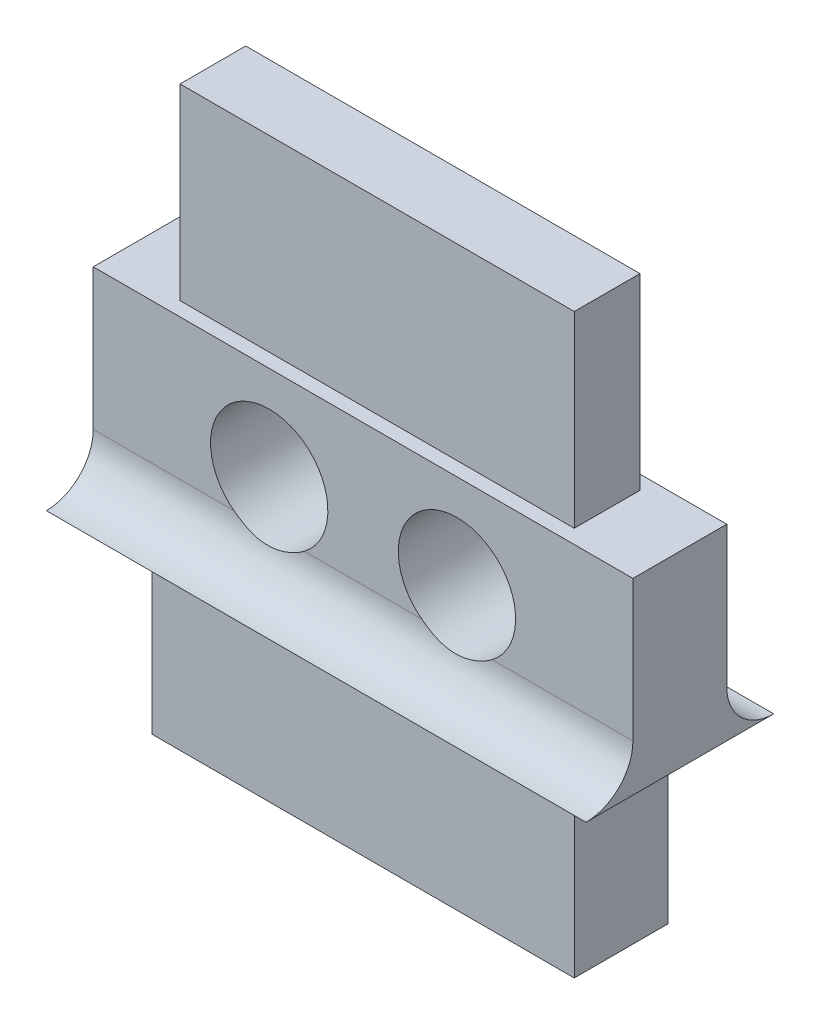
ISO-10303-21;
HEADER;
FILE_DESCRIPTION(('STEP AP214'),'2;1');
FILE_NAME('part.step','',(''),(''),'','','');
FILE_SCHEMA(('AUTOMOTIVE_DESIGN { 1 0 10303 214 1 1 1 1 }'));
ENDSEC;
DATA;
#1=APPLICATION_CONTEXT('core data for automotive mechanical design processes');
#2=APPLICATION_PROTOCOL_DEFINITION('international standard','automotive_design',2000,#1);
#3=PRODUCT_CONTEXT('',#1,'mechanical');
#4=PRODUCT('Part','Part','',(#3));
#5=PRODUCT_RELATED_PRODUCT_CATEGORY('part','',(#4));
#6=PRODUCT_DEFINITION_FORMATION('','',#4);
#7=PRODUCT_DEFINITION_CONTEXT('part definition',#1,'design');
#8=PRODUCT_DEFINITION('design','',#6,#7);
#9=PRODUCT_DEFINITION_SHAPE('','',#8);
#10=(LENGTH_UNIT() NAMED_UNIT(*) SI_UNIT(.MILLI.,.METRE.));
#11=(NAMED_UNIT(*) PLANE_ANGLE_UNIT() SI_UNIT($,.RADIAN.));
#12=(NAMED_UNIT(*) SI_UNIT($,.STERADIAN.) SOLID_ANGLE_UNIT());
#13=UNCERTAINTY_MEASURE_WITH_UNIT(LENGTH_MEASURE(1.E-05),#10,'distance_accuracy_value','');
#14=(GEOMETRIC_REPRESENTATION_CONTEXT(3) GLOBAL_UNCERTAINTY_ASSIGNED_CONTEXT((#13)) GLOBAL_UNIT_ASSIGNED_CONTEXT((#10,
#11,#12)) REPRESENTATION_CONTEXT('',''));
#15=CARTESIAN_POINT('',(0.,0.,0.));
#16=DIRECTION('',(0.,0.,1.));
#17=DIRECTION('',(1.,0.,0.));
#18=AXIS2_PLACEMENT_3D('',#15,#16,#17);
#19=CARTESIAN_POINT('',(0.,0.,0.));
#20=DIRECTION('',(0.,0.,1.));
#21=DIRECTION('',(1.,0.,0.));
#22=AXIS2_PLACEMENT_3D('',#19,#20,#21);
#23=PLANE('',#22);
#24=DIRECTION('',(-1.,0.,0.));
#25=VECTOR('',#24,1.);
#26=CARTESIAN_POINT('',(1.24999999999997,8.00000000000001,0.));
#27=LINE('',#26,#25);
#28=CARTESIAN_POINT('',(11.5007199999999,8.00000000000001,0.));
#29=VERTEX_POINT('',#28);
#30=CARTESIAN_POINT('',(0.,8.00000000000001,0.));
#31=VERTEX_POINT('',#30);
#32=EDGE_CURVE('E301',#29,#31,#27,.T.);
#33=ORIENTED_EDGE('',*,*,#32,.F.);
#34=DIRECTION('',(0.,1.,0.));
#35=VECTOR('',#34,1.);
#36=CARTESIAN_POINT('',(11.5007199999999,8.00000000000001,0.));
#37=LINE('',#36,#35);
#38=CARTESIAN_POINT('',(11.5007199999999,5.,0.));
#39=VERTEX_POINT('',#38);
#40=EDGE_CURVE('E62',#39,#29,#37,.T.);
#41=ORIENTED_EDGE('',*,*,#40,.F.);
#42=DIRECTION('',(-1.,0.,0.));
#43=VECTOR('',#42,1.);
#44=CARTESIAN_POINT('',(12.914933562373,5.,0.));
#45=LINE('',#44,#43);
#46=CARTESIAN_POINT('',(8.50071999999964,5.,0.));
#47=VERTEX_POINT('',#46);
#48=EDGE_CURVE('E236',#39,#47,#45,.T.);
#49=ORIENTED_EDGE('',*,*,#48,.T.);
#50=CARTESIAN_POINT('',(7.75071999999997,6.00000000000023,0.));
#51=DIRECTION('',(0.,0.,1.));
#52=DIRECTION('',(1.,0.,0.));
#53=AXIS2_PLACEMENT_3D('',#50,#51,#52);
#54=CIRCLE('',#53,1.24999999999998);
#55=CARTESIAN_POINT('',(7.00072000000032,5.,0.));
#56=VERTEX_POINT('',#55);
#57=EDGE_CURVE('E267',#47,#56,#54,.T.);
#58=ORIENTED_EDGE('',*,*,#57,.T.);
#59=CARTESIAN_POINT('',(4.49999999999962,5.,0.));
#60=VERTEX_POINT('',#59);
#61=EDGE_CURVE('E241',#56,#60,#45,.T.);
#62=ORIENTED_EDGE('',*,*,#61,.T.);
#63=CARTESIAN_POINT('',(3.74999999999997,6.00000000000023,0.));
#64=DIRECTION('',(0.,0.,1.));
#65=DIRECTION('',(1.,0.,0.));
#66=AXIS2_PLACEMENT_3D('',#63,#64,#65);
#67=CIRCLE('',#66,1.24999999999997);
#68=CARTESIAN_POINT('',(3.00000000000032,5.,0.));
#69=VERTEX_POINT('',#68);
#70=EDGE_CURVE('E263',#60,#69,#67,.T.);
#71=ORIENTED_EDGE('',*,*,#70,.T.);
#72=CARTESIAN_POINT('',(0.,5.,0.));
#73=VERTEX_POINT('',#72);
#74=EDGE_CURVE('E242',#69,#73,#45,.T.);
#75=ORIENTED_EDGE('',*,*,#74,.T.);
#76=DIRECTION('',(0.,-1.,0.));
#77=VECTOR('',#76,1.);
#78=CARTESIAN_POINT('',(0.,8.00000000000001,0.));
#79=LINE('',#78,#77);
#80=EDGE_CURVE('E280',#31,#73,#79,.T.);
#81=ORIENTED_EDGE('',*,*,#80,.F.);
#82=EDGE_LOOP('',(#33,#41,#49,#58,#62,#71,#75,#81));
#83=FACE_BOUND('',#82,.T.);
#84=ADVANCED_FACE('F34',(#83),#23,.F.);
#85=CARTESIAN_POINT('',(0.,0.,2.));
#86=DIRECTION('',(0.,0.,1.));
#87=DIRECTION('',(1.,0.,0.));
#88=AXIS2_PLACEMENT_3D('',#85,#86,#87);
#89=PLANE('',#88);
#90=DIRECTION('',(-1.,0.,0.));
#91=VECTOR('',#90,1.);
#92=CARTESIAN_POINT('',(10.25072,8.00000000000001,2.));
#93=LINE('',#92,#91);
#94=CARTESIAN_POINT('',(11.5007199999999,8.00000000000001,2.));
#95=VERTEX_POINT('',#94);
#96=CARTESIAN_POINT('',(0.,8.00000000000001,2.));
#97=VERTEX_POINT('',#96);
#98=EDGE_CURVE('E287',#95,#97,#93,.T.);
#99=ORIENTED_EDGE('',*,*,#98,.T.);
#100=DIRECTION('',(0.,-1.,0.));
#101=VECTOR('',#100,1.);
#102=CARTESIAN_POINT('',(0.,8.00000000000001,2.));
#103=LINE('',#102,#101);
#104=CARTESIAN_POINT('',(0.,5.,2.));
#105=VERTEX_POINT('',#104);
#106=EDGE_CURVE('E289',#97,#105,#103,.T.);
#107=ORIENTED_EDGE('',*,*,#106,.T.);
#108=DIRECTION('',(-1.,0.,0.));
#109=VECTOR('',#108,1.);
#110=CARTESIAN_POINT('',(12.914933562373,5.,2.));
#111=LINE('',#110,#109);
#112=CARTESIAN_POINT('',(3.00000000000032,5.,2.));
#113=VERTEX_POINT('',#112);
#114=EDGE_CURVE('E258',#113,#105,#111,.T.);
#115=ORIENTED_EDGE('',*,*,#114,.F.);
#116=CARTESIAN_POINT('',(3.74999999999997,6.00000000000023,2.));
#117=DIRECTION('',(0.,0.,1.));
#118=DIRECTION('',(1.,0.,0.));
#119=AXIS2_PLACEMENT_3D('',#116,#117,#118);
#120=CIRCLE('',#119,1.24999999999997);
#121=CARTESIAN_POINT('',(4.49999999999962,5.,2.));
#122=VERTEX_POINT('',#121);
#123=EDGE_CURVE('E264',#122,#113,#120,.T.);
#124=ORIENTED_EDGE('',*,*,#123,.F.);
#125=CARTESIAN_POINT('',(7.00072000000031,5.,2.));
#126=VERTEX_POINT('',#125);
#127=EDGE_CURVE('E257',#126,#122,#111,.T.);
#128=ORIENTED_EDGE('',*,*,#127,.F.);
#129=CARTESIAN_POINT('',(7.75071999999997,6.00000000000023,2.));
#130=DIRECTION('',(0.,0.,1.));
#131=DIRECTION('',(1.,0.,0.));
#132=AXIS2_PLACEMENT_3D('',#129,#130,#131);
#133=CIRCLE('',#132,1.24999999999998);
#134=CARTESIAN_POINT('',(8.50071999999963,5.,2.));
#135=VERTEX_POINT('',#134);
#136=EDGE_CURVE('E270',#135,#126,#133,.T.);
#137=ORIENTED_EDGE('',*,*,#136,.F.);
#138=CARTESIAN_POINT('',(11.5007199999999,5.,2.));
#139=VERTEX_POINT('',#138);
#140=EDGE_CURVE('E254',#139,#135,#111,.T.);
#141=ORIENTED_EDGE('',*,*,#140,.F.);
#142=DIRECTION('',(0.,1.,0.));
#143=VECTOR('',#142,1.);
#144=CARTESIAN_POINT('',(11.5007199999999,8.00000000000001,2.));
#145=LINE('',#144,#143);
#146=EDGE_CURVE('E285',#139,#95,#145,.T.);
#147=ORIENTED_EDGE('',*,*,#146,.T.);
#148=EDGE_LOOP('',(#99,#107,#115,#124,#128,#137,#141,#147));
#149=FACE_BOUND('',#148,.T.);
#150=ADVANCED_FACE('F343',(#149),#89,.T.);
#151=DIRECTION('',(-1.,0.,0.));
#152=VECTOR('',#151,1.);
#153=CARTESIAN_POINT('',(12.914933562373,4.,2.));
#154=LINE('',#153,#152);
#155=CARTESIAN_POINT('',(10.25072,4.,2.));
#156=VERTEX_POINT('',#155);
#157=CARTESIAN_POINT('',(1.24999999999997,4.,2.));
#158=VERTEX_POINT('',#157);
#159=EDGE_CURVE('E251',#156,#158,#154,.T.);
#160=ORIENTED_EDGE('',*,*,#159,.T.);
#161=DIRECTION('',(0.,-1.,0.));
#162=VECTOR('',#161,1.);
#163=CARTESIAN_POINT('',(1.24999999999997,4.,2.));
#164=LINE('',#163,#162);
#165=CARTESIAN_POINT('',(1.24999999999997,0.,2.));
#166=VERTEX_POINT('',#165);
#167=EDGE_CURVE('E276',#158,#166,#164,.T.);
#168=ORIENTED_EDGE('',*,*,#167,.T.);
#169=DIRECTION('',(1.,0.,0.));
#170=VECTOR('',#169,1.);
#171=CARTESIAN_POINT('',(1.24999999999997,0.,2.));
#172=LINE('',#171,#170);
#173=CARTESIAN_POINT('',(10.25072,0.,2.));
#174=VERTEX_POINT('',#173);
#175=EDGE_CURVE('E279',#166,#174,#172,.T.);
#176=ORIENTED_EDGE('',*,*,#175,.T.);
#177=DIRECTION('',(0.,1.,0.));
#178=VECTOR('',#177,1.);
#179=CARTESIAN_POINT('',(10.25072,4.,2.));
#180=LINE('',#179,#178);
#181=EDGE_CURVE('E282',#174,#156,#180,.T.);
#182=ORIENTED_EDGE('',*,*,#181,.T.);
#183=EDGE_LOOP('',(#160,#168,#176,#182));
#184=FACE_BOUND('',#183,.T.);
#185=ADVANCED_FACE('F341',(#184),#89,.T.);
#186=DIRECTION('',(0.,-1.,0.));
#187=VECTOR('',#186,1.);
#188=CARTESIAN_POINT('',(1.24999999999997,4.,0.));
#189=LINE('',#188,#187);
#190=CARTESIAN_POINT('',(1.24999999999997,4.,0.));
#191=VERTEX_POINT('',#190);
#192=CARTESIAN_POINT('',(1.24999999999997,0.,0.));
#193=VERTEX_POINT('',#192);
#194=EDGE_CURVE('E273',#191,#193,#189,.T.);
#195=ORIENTED_EDGE('',*,*,#194,.F.);
#196=DIRECTION('',(-1.,0.,0.));
#197=VECTOR('',#196,1.);
#198=CARTESIAN_POINT('',(12.914933562373,4.,0.));
#199=LINE('',#198,#197);
#200=CARTESIAN_POINT('',(10.25072,4.,0.));
#201=VERTEX_POINT('',#200);
#202=EDGE_CURVE('E243',#201,#191,#199,.T.);
#203=ORIENTED_EDGE('',*,*,#202,.F.);
#204=DIRECTION('',(0.,1.,0.));
#205=VECTOR('',#204,1.);
#206=CARTESIAN_POINT('',(10.25072,4.,0.));
#207=LINE('',#206,#205);
#208=CARTESIAN_POINT('',(10.25072,0.,0.));
#209=VERTEX_POINT('',#208);
#210=EDGE_CURVE('E297',#209,#201,#207,.T.);
#211=ORIENTED_EDGE('',*,*,#210,.F.);
#212=DIRECTION('',(1.,0.,0.));
#213=VECTOR('',#212,1.);
#214=CARTESIAN_POINT('',(1.24999999999997,0.,0.));
#215=LINE('',#214,#213);
#216=EDGE_CURVE('E295',#193,#209,#215,.T.);
#217=ORIENTED_EDGE('',*,*,#216,.F.);
#218=EDGE_LOOP('',(#195,#203,#211,#217));
#219=FACE_BOUND('',#218,.T.);
#220=ADVANCED_FACE('F331',(#219),#23,.F.);
#221=CARTESIAN_POINT('',(1.24999999999997,4.,2.));
#222=DIRECTION('',(1.,0.,0.));
#223=DIRECTION('',(0.,1.,0.));
#224=AXIS2_PLACEMENT_3D('',#221,#222,#223);
#225=PLANE('',#224);
#226=ORIENTED_EDGE('',*,*,#194,.T.);
#227=DIRECTION('',(0.,0.,-1.));
#228=VECTOR('',#227,1.);
#229=CARTESIAN_POINT('',(1.24999999999997,0.,2.));
#230=LINE('',#229,#228);
#231=EDGE_CURVE('E47',#166,#193,#230,.T.);
#232=ORIENTED_EDGE('',*,*,#231,.F.);
#233=ORIENTED_EDGE('',*,*,#167,.F.);
#234=DIRECTION('',(0.,0.,-1.));
#235=VECTOR('',#234,1.);
#236=CARTESIAN_POINT('',(1.24999999999997,4.,2.));
#237=LINE('',#236,#235);
#238=EDGE_CURVE('E292',#158,#191,#237,.T.);
#239=ORIENTED_EDGE('',*,*,#238,.T.);
#240=EDGE_LOOP('',(#226,#232,#233,#239));
#241=FACE_BOUND('',#240,.T.);
#242=ADVANCED_FACE('F36',(#241),#225,.F.);
#243=CARTESIAN_POINT('',(1.24999999999997,0.,2.));
#244=DIRECTION('',(0.,1.,0.));
#245=DIRECTION('',(-1.,0.,0.));
#246=AXIS2_PLACEMENT_3D('',#243,#244,#245);
#247=PLANE('',#246);
#248=ORIENTED_EDGE('',*,*,#216,.T.);
#249=DIRECTION('',(0.,0.,-1.));
#250=VECTOR('',#249,1.);
#251=CARTESIAN_POINT('',(10.25072,0.,2.));
#252=LINE('',#251,#250);
#253=EDGE_CURVE('E319',#174,#209,#252,.T.);
#254=ORIENTED_EDGE('',*,*,#253,.F.);
#255=ORIENTED_EDGE('',*,*,#175,.F.);
#256=ORIENTED_EDGE('',*,*,#231,.T.);
#257=EDGE_LOOP('',(#248,#254,#255,#256));
#258=FACE_BOUND('',#257,.T.);
#259=ADVANCED_FACE('F324',(#258),#247,.F.);
#260=CARTESIAN_POINT('',(10.25072,4.,2.));
#261=DIRECTION('',(-1.,0.,0.));
#262=DIRECTION('',(0.,-1.,0.));
#263=AXIS2_PLACEMENT_3D('',#260,#261,#262);
#264=PLANE('',#263);
#265=ORIENTED_EDGE('',*,*,#210,.T.);
#266=DIRECTION('',(0.,0.,-1.));
#267=VECTOR('',#266,1.);
#268=CARTESIAN_POINT('',(10.25072,4.,2.));
#269=LINE('',#268,#267);
#270=EDGE_CURVE('E316',#156,#201,#269,.T.);
#271=ORIENTED_EDGE('',*,*,#270,.F.);
#272=ORIENTED_EDGE('',*,*,#181,.F.);
#273=ORIENTED_EDGE('',*,*,#253,.T.);
#274=EDGE_LOOP('',(#265,#271,#272,#273));
#275=FACE_BOUND('',#274,.T.);
#276=ADVANCED_FACE('F339',(#275),#264,.F.);
#277=CARTESIAN_POINT('',(11.5007199999999,8.00000000000001,2.));
#278=DIRECTION('',(-1.,0.,0.));
#279=DIRECTION('',(0.,0.,1.));
#280=AXIS2_PLACEMENT_3D('',#277,#278,#279);
#281=PLANE('',#280);
#282=DIRECTION('',(0.,0.,-1.));
#283=VECTOR('',#282,1.);
#284=CARTESIAN_POINT('',(11.5007199999999,4.,2.));
#285=LINE('',#284,#283);
#286=CARTESIAN_POINT('',(11.5007199999999,4.,3.));
#287=VERTEX_POINT('',#286);
#288=CARTESIAN_POINT('',(11.5007199999999,4.,-1.));
#289=VERTEX_POINT('',#288);
#290=EDGE_CURVE('E314',#287,#289,#285,.T.);
#291=ORIENTED_EDGE('',*,*,#290,.T.);
#292=CARTESIAN_POINT('',(11.5007199999999,5.,-1.));
#293=DIRECTION('',(-1.,0.,0.));
#294=DIRECTION('',(0.,0.,1.));
#295=AXIS2_PLACEMENT_3D('',#292,#293,#294);
#296=CIRCLE('',#295,1.);
#297=EDGE_CURVE('E233',#289,#39,#296,.T.);
#298=ORIENTED_EDGE('',*,*,#297,.T.);
#299=ORIENTED_EDGE('',*,*,#40,.T.);
#300=DIRECTION('',(0.,0.,-1.));
#301=VECTOR('',#300,1.);
#302=CARTESIAN_POINT('',(11.5007199999999,8.00000000000001,2.));
#303=LINE('',#302,#301);
#304=EDGE_CURVE('E311',#95,#29,#303,.T.);
#305=ORIENTED_EDGE('',*,*,#304,.F.);
#306=ORIENTED_EDGE('',*,*,#146,.F.);
#307=CARTESIAN_POINT('',(11.5007199999999,5.,3.));
#308=DIRECTION('',(-1.,0.,0.));
#309=DIRECTION('',(0.,0.,1.));
#310=AXIS2_PLACEMENT_3D('',#307,#308,#309);
#311=CIRCLE('',#310,1.);
#312=EDGE_CURVE('E253',#139,#287,#311,.T.);
#313=ORIENTED_EDGE('',*,*,#312,.T.);
#314=EDGE_LOOP('',(#291,#298,#299,#305,#306,#313));
#315=FACE_BOUND('',#314,.T.);
#316=ADVANCED_FACE('F365',(#315),#281,.F.);
#317=CARTESIAN_POINT('',(1.24999999999997,8.00000000000001,2.));
#318=DIRECTION('',(0.,-1.,0.));
#319=DIRECTION('',(0.,0.,-1.));
#320=AXIS2_PLACEMENT_3D('',#317,#318,#319);
#321=PLANE('',#320);
#322=ORIENTED_EDGE('',*,*,#32,.T.);
#323=DIRECTION('',(0.,0.,-1.));
#324=VECTOR('',#323,1.);
#325=CARTESIAN_POINT('',(0.,8.00000000000001,2.));
#326=LINE('',#325,#324);
#327=EDGE_CURVE('E308',#97,#31,#326,.T.);
#328=ORIENTED_EDGE('',*,*,#327,.F.);
#329=ORIENTED_EDGE('',*,*,#98,.F.);
#330=ORIENTED_EDGE('',*,*,#304,.T.);
#331=EDGE_LOOP('',(#322,#328,#329,#330));
#332=FACE_BOUND('',#331,.T.);
#333=DIRECTION('',(0.,0.,-1.));
#334=VECTOR('',#333,1.);
#335=CARTESIAN_POINT('',(9.95071999999997,8.00000000000001,0.3));
#336=LINE('',#335,#334);
#337=CARTESIAN_POINT('',(9.95071999999997,8.00000000000001,1.7));
#338=VERTEX_POINT('',#337);
#339=CARTESIAN_POINT('',(9.95071999999997,8.00000000000001,0.3));
#340=VERTEX_POINT('',#339);
#341=EDGE_CURVE('E182',#338,#340,#336,.T.);
#342=ORIENTED_EDGE('',*,*,#341,.F.);
#343=DIRECTION('',(1.,0.,0.));
#344=VECTOR('',#343,1.);
#345=CARTESIAN_POINT('',(9.95071999999997,8.00000000000001,1.7));
#346=LINE('',#345,#344);
#347=CARTESIAN_POINT('',(1.54999999999997,8.00000000000001,1.7));
#348=VERTEX_POINT('',#347);
#349=EDGE_CURVE('E176',#348,#338,#346,.T.);
#350=ORIENTED_EDGE('',*,*,#349,.F.);
#351=DIRECTION('',(0.,0.,1.));
#352=VECTOR('',#351,1.);
#353=CARTESIAN_POINT('',(1.54999999999997,8.00000000000001,0.300000000000001));
#354=LINE('',#353,#352);
#355=CARTESIAN_POINT('',(1.54999999999997,8.00000000000001,0.300000000000001));
#356=VERTEX_POINT('',#355);
#357=EDGE_CURVE('E185',#356,#348,#354,.T.);
#358=ORIENTED_EDGE('',*,*,#357,.F.);
#359=DIRECTION('',(-1.,0.,0.));
#360=VECTOR('',#359,1.);
#361=CARTESIAN_POINT('',(9.95071999999997,8.00000000000001,0.3));
#362=LINE('',#361,#360);
#363=EDGE_CURVE('E168',#340,#356,#362,.T.);
#364=ORIENTED_EDGE('',*,*,#363,.F.);
#365=EDGE_LOOP('',(#342,#350,#358,#364));
#366=FACE_BOUND('',#365,.T.);
#367=ADVANCED_FACE('F180',(#332,#366),#321,.F.);
#368=CARTESIAN_POINT('',(0.,8.00000000000001,2.));
#369=DIRECTION('',(1.,0.,0.));
#370=DIRECTION('',(0.,1.,0.));
#371=AXIS2_PLACEMENT_3D('',#368,#369,#370);
#372=PLANE('',#371);
#373=ORIENTED_EDGE('',*,*,#80,.T.);
#374=CARTESIAN_POINT('',(0.,5.,-1.));
#375=DIRECTION('',(1.,0.,0.));
#376=DIRECTION('',(0.,1.,0.));
#377=AXIS2_PLACEMENT_3D('',#374,#375,#376);
#378=CIRCLE('',#377,1.);
#379=CARTESIAN_POINT('',(0.,4.,-1.));
#380=VERTEX_POINT('',#379);
#381=EDGE_CURVE('E232',#73,#380,#378,.T.);
#382=ORIENTED_EDGE('',*,*,#381,.T.);
#383=DIRECTION('',(0.,0.,-1.));
#384=VECTOR('',#383,1.);
#385=CARTESIAN_POINT('',(0.,4.,2.));
#386=LINE('',#385,#384);
#387=CARTESIAN_POINT('',(0.,4.,3.));
#388=VERTEX_POINT('',#387);
#389=EDGE_CURVE('E306',#388,#380,#386,.T.);
#390=ORIENTED_EDGE('',*,*,#389,.F.);
#391=CARTESIAN_POINT('',(0.,5.,3.));
#392=DIRECTION('',(1.,0.,0.));
#393=DIRECTION('',(0.,-1.,0.));
#394=AXIS2_PLACEMENT_3D('',#391,#392,#393);
#395=CIRCLE('',#394,1.);
#396=EDGE_CURVE('E235',#388,#105,#395,.T.);
#397=ORIENTED_EDGE('',*,*,#396,.T.);
#398=ORIENTED_EDGE('',*,*,#106,.F.);
#399=ORIENTED_EDGE('',*,*,#327,.T.);
#400=EDGE_LOOP('',(#373,#382,#390,#397,#398,#399));
#401=FACE_BOUND('',#400,.T.);
#402=ADVANCED_FACE('F359',(#401),#372,.F.);
#403=CARTESIAN_POINT('',(1.24999999999997,4.,2.));
#404=DIRECTION('',(0.,1.,0.));
#405=DIRECTION('',(0.,0.,1.));
#406=AXIS2_PLACEMENT_3D('',#403,#404,#405);
#407=PLANE('',#406);
#408=ORIENTED_EDGE('',*,*,#202,.T.);
#409=ORIENTED_EDGE('',*,*,#238,.F.);
#410=ORIENTED_EDGE('',*,*,#159,.F.);
#411=ORIENTED_EDGE('',*,*,#270,.T.);
#412=EDGE_LOOP('',(#408,#409,#410,#411));
#413=FACE_BOUND('',#412,.T.);
#414=ORIENTED_EDGE('',*,*,#389,.T.);
#415=DIRECTION('',(-1.,0.,0.));
#416=VECTOR('',#415,1.);
#417=CARTESIAN_POINT('',(12.914933562373,4.,-1.));
#418=LINE('',#417,#416);
#419=EDGE_CURVE('E239',#289,#380,#418,.T.);
#420=ORIENTED_EDGE('',*,*,#419,.F.);
#421=ORIENTED_EDGE('',*,*,#290,.F.);
#422=DIRECTION('',(-1.,0.,0.));
#423=VECTOR('',#422,1.);
#424=CARTESIAN_POINT('',(12.914933562373,4.,3.));
#425=LINE('',#424,#423);
#426=EDGE_CURVE('E250',#287,#388,#425,.T.);
#427=ORIENTED_EDGE('',*,*,#426,.T.);
#428=EDGE_LOOP('',(#414,#420,#421,#427));
#429=FACE_BOUND('',#428,.T.);
#430=ADVANCED_FACE('F334',(#413,#429),#407,.F.);
#431=CARTESIAN_POINT('',(7.75071999999997,6.00000000000023,2.));
#432=DIRECTION('',(0.,0.,-1.));
#433=DIRECTION('',(-1.,0.,0.));
#434=AXIS2_PLACEMENT_3D('',#431,#432,#433);
#435=CYLINDRICAL_SURFACE('',#434,1.24999999999998);
#436=ORIENTED_EDGE('',*,*,#136,.T.);
#437=CARTESIAN_POINT('',(6.50072,6.,3.));
#438=CARTESIAN_POINT('',(6.50072532169146,5.99999978361962,2.97204992704358));
#439=CARTESIAN_POINT('',(6.50071939610446,5.99882745440819,2.9441131972668));
#440=CARTESIAN_POINT('',(6.50073046598745,5.99415030073656,2.88843631015914));
#441=CARTESIAN_POINT('',(6.50074746097995,5.99064552486542,2.86069614874554));
#442=CARTESIAN_POINT('',(6.50090094022251,5.97665054069726,2.77802649176053));
#443=CARTESIAN_POINT('',(6.50113990971723,5.96267967333993,2.72364483905864));
#444=CARTESIAN_POINT('',(6.50278662214765,5.92584624654431,2.61797088191552));
#445=CARTESIAN_POINT('',(6.50419535772504,5.90297614414265,2.5666812409598));
#446=CARTESIAN_POINT('',(6.50957283886306,5.84905409519246,2.46875147393668));
#447=CARTESIAN_POINT('',(6.51353998426913,5.81800726994184,2.422108462677));
#448=CARTESIAN_POINT('',(6.52554707147617,5.74976709316367,2.33608412192638));
#449=CARTESIAN_POINT('',(6.53347946503019,5.71275267904168,2.2965466821992));
#450=CARTESIAN_POINT('',(6.55488696571303,5.6337368256466,2.2246138986495));
#451=CARTESIAN_POINT('',(6.5683566501472,5.59174029392989,2.19221161487647));
#452=CARTESIAN_POINT('',(6.60033915577241,5.50919134506977,2.13806611689877));
#453=CARTESIAN_POINT('',(6.61825588390264,5.46887683924685,2.11560544227966));
#454=CARTESIAN_POINT('',(6.65980351938817,5.38806641572971,2.07728408580201));
#455=CARTESIAN_POINT('',(6.68343424400287,5.34757050387771,2.0614231929185));
#456=CARTESIAN_POINT('',(6.73523659665331,5.2696514541779,2.03619966154708));
#457=CARTESIAN_POINT('',(6.76322393193426,5.23217052849071,2.02663214527757));
#458=CARTESIAN_POINT('',(6.82374194947047,5.16010161782889,2.0122144777549));
#459=CARTESIAN_POINT('',(6.856274290725,5.12551469661602,2.00736605421709));
#460=CARTESIAN_POINT('',(6.92945872859267,5.05613898673155,2.0008963891932));
#461=CARTESIAN_POINT('',(6.9706172919172,5.02184368283418,1.99974280360213));
#462=CARTESIAN_POINT('',(7.05697101598225,4.95880959112038,2.00035077178162));
#463=CARTESIAN_POINT('',(7.10216939804423,4.93007529644919,2.00211467190863));
#464=CARTESIAN_POINT('',(7.20524370870765,4.87346978488139,2.00755027815467));
#465=CARTESIAN_POINT('',(7.26384075093854,4.84693522897629,2.01153441073528));
#466=CARTESIAN_POINT('',(7.38442418322838,4.80315151527515,2.01931330599981));
#467=CARTESIAN_POINT('',(7.44641164051076,4.78590529997748,2.02310800832818));
#468=CARTESIAN_POINT('',(7.57842588452386,4.75993775182277,2.02913832605215));
#469=CARTESIAN_POINT('',(7.64865574404498,4.75218578355409,2.03119083642386));
#470=CARTESIAN_POINT('',(7.78942421870189,4.74861724429449,2.03211032718628));
#471=CARTESIAN_POINT('',(7.8599627717348,4.7527983737185,2.03097792133153));
#472=CARTESIAN_POINT('',(7.99719495889271,4.77263724561326,2.02614044681261));
#473=CARTESIAN_POINT('',(8.063940750725,4.78795762791373,2.02251116782302));
#474=CARTESIAN_POINT('',(8.19406539328195,4.82926926560037,2.0144593500494));
#475=CARTESIAN_POINT('',(8.25744046850784,4.85527221346863,2.0100359450599));
#476=CARTESIAN_POINT('',(8.38102967718007,4.91825821224949,2.0028273129751));
#477=CARTESIAN_POINT('',(8.44109165479262,4.9555476557265,2.00009529153889));
#478=CARTESIAN_POINT('',(8.55403621794822,5.0397337462953,1.99991026215672));
#479=CARTESIAN_POINT('',(8.60693400316511,5.08660950679127,2.00244588528641));
#480=CARTESIAN_POINT('',(8.69017928767852,5.17387180734177,2.01453855024301));
#481=CARTESIAN_POINT('',(8.72271722033839,5.212467219141,2.02195960479528));
#482=CARTESIAN_POINT('',(8.78224679651315,5.29224299954566,2.0427710050816));
#483=CARTESIAN_POINT('',(8.80924376580793,5.33342083582994,2.05615557927127));
#484=CARTESIAN_POINT('',(8.85733112585975,5.41670278630373,2.08984480805756));
#485=CARTESIAN_POINT('',(8.8783937406162,5.4588102931143,2.11018104988533));
#486=CARTESIAN_POINT('',(8.91449184072981,5.54155119806155,2.15797690000796));
#487=CARTESIAN_POINT('',(8.92952668708271,5.58218443949619,2.18543726302353));
#488=CARTESIAN_POINT('',(8.95335054186465,5.65704979983648,2.24475039840749));
#489=CARTESIAN_POINT('',(8.96251286282049,5.69153236049709,2.27614137822856));
#490=CARTESIAN_POINT('',(8.9771443623878,5.75611198943674,2.34388549282698));
#491=CARTESIAN_POINT('',(8.9826129359274,5.78620833857858,2.38023943941481));
#492=CARTESIAN_POINT('',(8.99112313416134,5.84263813582409,2.45921483165553));
#493=CARTESIAN_POINT('',(8.99400887923185,5.86865984337178,2.50207525475577));
#494=CARTESIAN_POINT('',(8.99796868948614,5.91403249458111,2.59127815841558));
#495=CARTESIAN_POINT('',(8.99904163383959,5.93337930536606,2.63762277472509));
#496=CARTESIAN_POINT('',(9.00037107652992,5.96595332765261,2.73584249898936));
#497=CARTESIAN_POINT('',(9.00056947887205,5.97869656184542,2.78788101534216));
#498=CARTESIAN_POINT('',(9.00069708521,5.99146460992094,2.8669085241022));
#499=CARTESIAN_POINT('',(9.00071126209137,5.99466283273372,2.89342243079684));
#500=CARTESIAN_POINT('',(9.00072052862289,5.99893031356652,2.94662017774424));
#501=CARTESIAN_POINT('',(9.00071561890911,5.99999964253087,2.97330401230451));
#502=CARTESIAN_POINT('',(9.00071999999995,6.,3.));
#503=B_SPLINE_CURVE_WITH_KNOTS('',3,(#437,#438,#439,#440,#441,#442,#443,#444,#445,#446,#447,
#448,#449,#450,#451,#452,#453,#454,#455,#456,#457,#458,#459,#460,#461,#462,#463,#464,#465,#466,
#467,#468,#469,#470,#471,#472,#473,#474,#475,#476,#477,#478,#479,#480,#481,#482,#483,#484,#485,
#486,#487,#488,#489,#490,#491,#492,#493,#494,#495,#496,#497,#498,#499,#500,#501,#502),
.UNSPECIFIED.,.F.,.F.,(4,2,2,2,2,2,2,2,2,2,2,2,2,2,2,2,2,2,2,2,2,2,2,2,2,2,2,2,2,2,2,2,4),(0.,
0.0837991264591867,0.167596507286032,0.335182428328774,0.502910705164787,0.670534178146347,
0.83383965075248,0.996985577091702,1.1447307915601,1.2924712815802,1.4351265755665,
1.57783407771075,1.73800933032284,1.898313464803,2.09086826397854,2.2834840276932,
2.49446115488416,2.70539762816395,2.91019854784175,3.11522422983577,3.32640921793773,
3.53713888837388,3.6895840208512,3.84188193504676,3.99488127288407,4.14789682590834,
4.2898369515479,4.43180032273025,4.58184518650066,4.73198278709179,4.89195684490057,
4.97200189248414,5.05204427256112),.UNSPECIFIED.);
#504=EDGE_CURVE('E201',#126,#135,#503,.T.);
#505=ORIENTED_EDGE('',*,*,#504,.T.);
#506=EDGE_LOOP('',(#436,#505));
#507=FACE_BOUND('',#506,.T.);
#508=ORIENTED_EDGE('',*,*,#57,.F.);
#509=CARTESIAN_POINT('',(9.00071999999995,6.00000000000023,-1.));
#510=CARTESIAN_POINT('',(9.0007146783085,5.9999997836197,-0.972049927043585));
#511=CARTESIAN_POINT('',(9.00072060389549,5.99882745440822,-0.944113197266816));
#512=CARTESIAN_POINT('',(9.00070953401251,5.99415030073654,-0.888436310159157));
#513=CARTESIAN_POINT('',(9.00069253902,5.99064552486541,-0.860696148745559));
#514=CARTESIAN_POINT('',(9.00053905977744,5.97665054069728,-0.778026491760542));
#515=CARTESIAN_POINT('',(9.00030009028272,5.96267967333993,-0.723644839058651));
#516=CARTESIAN_POINT('',(8.99865337785231,5.92584624654431,-0.617970881915522));
#517=CARTESIAN_POINT('',(8.99724464227491,5.90297614414265,-0.566681240959797));
#518=CARTESIAN_POINT('',(8.99186716113689,5.84905409519246,-0.46875147393668));
#519=CARTESIAN_POINT('',(8.98790001573082,5.81800726994184,-0.422108462677004));
#520=CARTESIAN_POINT('',(8.97589292852379,5.74976709316367,-0.336084121926386));
#521=CARTESIAN_POINT('',(8.96796053496976,5.71275267904169,-0.296546682199207));
#522=CARTESIAN_POINT('',(8.94655303428693,5.6337368256466,-0.2246138986495));
#523=CARTESIAN_POINT('',(8.93308334985275,5.5917402939299,-0.192211614876471));
#524=CARTESIAN_POINT('',(8.90110084422754,5.50919134506978,-0.138066116898775));
#525=CARTESIAN_POINT('',(8.88318411609732,5.46887683924686,-0.115605442279658));
#526=CARTESIAN_POINT('',(8.84163648061178,5.38806641572971,-0.0772840858020151));
#527=CARTESIAN_POINT('',(8.81800575599709,5.34757050387772,-0.0614231929185052));
#528=CARTESIAN_POINT('',(8.76620340334664,5.26965145417791,-0.0361996615470828));
#529=CARTESIAN_POINT('',(8.7382160680657,5.23217052849072,-0.0266321452775715));
#530=CARTESIAN_POINT('',(8.67769805052948,5.16010161782889,-0.0122144777548965));
#531=CARTESIAN_POINT('',(8.64516570927496,5.12551469661603,-0.00736605421709508));
#532=CARTESIAN_POINT('',(8.57198127140729,5.05613898673155,-0.000896389193199293));
#533=CARTESIAN_POINT('',(8.53082270808275,5.02184368283418,0.000257196397874055));
#534=CARTESIAN_POINT('',(8.4444689840177,4.95880959112039,-0.000350771781617829));
#535=CARTESIAN_POINT('',(8.39927060195573,4.9300752964492,-0.00211467190862638));
#536=CARTESIAN_POINT('',(8.29619629129231,4.87346978488139,-0.00755027815466965));
#537=CARTESIAN_POINT('',(8.23759924906142,4.84693522897629,-0.0115344107352799));
#538=CARTESIAN_POINT('',(8.11701581677158,4.80315151527515,-0.0193133059998094));
#539=CARTESIAN_POINT('',(8.05502835948919,4.78590529997748,-0.0231080083281837));
#540=CARTESIAN_POINT('',(7.9230141154761,4.75993775182277,-0.0291383260521484));
#541=CARTESIAN_POINT('',(7.85278425595498,4.75218578355409,-0.0311908364238647));
#542=CARTESIAN_POINT('',(7.71201578129807,4.74861724429449,-0.032110327186275));
#543=CARTESIAN_POINT('',(7.64147722826516,4.7527983737185,-0.0309779213315299));
#544=CARTESIAN_POINT('',(7.50424504110725,4.77263724561326,-0.0261404468126092));
#545=CARTESIAN_POINT('',(7.43749924927496,4.78795762791373,-0.0225111678230187));
#546=CARTESIAN_POINT('',(7.30737460671801,4.82926926560037,-0.0144593500494017));
#547=CARTESIAN_POINT('',(7.24399953149211,4.85527221346863,-0.0100359450599042));
#548=CARTESIAN_POINT('',(7.12041032281989,4.91825821224948,-0.00282731297510131));
#549=CARTESIAN_POINT('',(7.06034834520733,4.9555476557265,-9.52915388884311E-05));
#550=CARTESIAN_POINT('',(6.94740378205173,5.0397337462953,8.973784328037E-05));
#551=CARTESIAN_POINT('',(6.89450599683485,5.08660950679127,-0.00244588528641195));
#552=CARTESIAN_POINT('',(6.81126071232144,5.17387180734177,-0.0145385502430097));
#553=CARTESIAN_POINT('',(6.77872277966157,5.212467219141,-0.0219596047952745));
#554=CARTESIAN_POINT('',(6.7191932034868,5.29224299954566,-0.0427710050815939));
#555=CARTESIAN_POINT('',(6.69219623419203,5.33342083582994,-0.0561555792712712));
#556=CARTESIAN_POINT('',(6.64410887414021,5.41670278630373,-0.0898448080575548));
#557=CARTESIAN_POINT('',(6.62304625938375,5.45881029311429,-0.110181049885329));
#558=CARTESIAN_POINT('',(6.58694815927015,5.54155119806154,-0.157976900007953));
#559=CARTESIAN_POINT('',(6.57191331291724,5.58218443949618,-0.185437263023527));
#560=CARTESIAN_POINT('',(6.5480894581353,5.65704979983647,-0.244750398407487));
#561=CARTESIAN_POINT('',(6.53892713717947,5.69153236049709,-0.276141378228559));
#562=CARTESIAN_POINT('',(6.52429563761215,5.75611198943674,-0.343885492826977));
#563=CARTESIAN_POINT('',(6.51882706407255,5.78620833857857,-0.38023943941481));
#564=CARTESIAN_POINT('',(6.51031686583861,5.84263813582409,-0.459214831655522));
#565=CARTESIAN_POINT('',(6.50743112076811,5.86865984337177,-0.502075254755766));
#566=CARTESIAN_POINT('',(6.50347131051381,5.91403249458111,-0.591278158415578));
#567=CARTESIAN_POINT('',(6.50239836616036,5.93337930536606,-0.637622774725083));
#568=CARTESIAN_POINT('',(6.50106892347003,5.96595332765261,-0.735842498989359));
#569=CARTESIAN_POINT('',(6.50087052112791,5.97869656184542,-0.787881015342155));
#570=CARTESIAN_POINT('',(6.50074291478995,5.99146460992094,-0.866908524102197));
#571=CARTESIAN_POINT('',(6.50072873790858,5.99466283273372,-0.893422430796835));
#572=CARTESIAN_POINT('',(6.50071947137706,5.99893031356652,-0.946620177744236));
#573=CARTESIAN_POINT('',(6.50072438109084,5.99999964253087,-0.973304012304506));
#574=CARTESIAN_POINT('',(6.50072,6.,-1.));
#575=B_SPLINE_CURVE_WITH_KNOTS('',3,(#509,#510,#511,#512,#513,#514,#515,#516,#517,#518,#519,
#520,#521,#522,#523,#524,#525,#526,#527,#528,#529,#530,#531,#532,#533,#534,#535,#536,#537,#538,
#539,#540,#541,#542,#543,#544,#545,#546,#547,#548,#549,#550,#551,#552,#553,#554,#555,#556,#557,
#558,#559,#560,#561,#562,#563,#564,#565,#566,#567,#568,#569,#570,#571,#572,#573,#574),
.UNSPECIFIED.,.F.,.F.,(4,2,2,2,2,2,2,2,2,2,2,2,2,2,2,2,2,2,2,2,2,2,2,2,2,2,2,2,2,2,2,2,4),(0.,
0.0837991264591764,0.167596507286022,0.335182428328781,0.502910705164796,0.670534178146351,
0.833839650752481,0.996985577091706,1.14473079156011,1.29247128158021,1.4351265755665,
1.57783407771076,1.73800933032285,1.898313464803,2.09086826397854,2.2834840276932,
2.49446115488416,2.70539762816395,2.91019854784175,3.11522422983577,3.32640921793773,
3.53713888837388,3.6895840208512,3.84188193504677,3.99488127288407,4.14789682590835,
4.2898369515479,4.43180032273026,4.58184518650067,4.7319827870918,4.89195684490058,
4.97200189248415,5.05204427256113),.UNSPECIFIED.);
#576=EDGE_CURVE('E11',#47,#56,#575,.T.);
#577=ORIENTED_EDGE('',*,*,#576,.T.);
#578=EDGE_LOOP('',(#508,#577));
#579=FACE_BOUND('',#578,.T.);
#580=ADVANCED_FACE('F358',(#507,#579),#435,.F.);
#581=CARTESIAN_POINT('',(3.74999999999997,6.00000000000023,2.));
#582=DIRECTION('',(0.,0.,-1.));
#583=DIRECTION('',(-1.,0.,0.));
#584=AXIS2_PLACEMENT_3D('',#581,#582,#583);
#585=CYLINDRICAL_SURFACE('',#584,1.24999999999997);
#586=ORIENTED_EDGE('',*,*,#123,.T.);
#587=CARTESIAN_POINT('',(3.00000000000032,5.,2.));
#588=CARTESIAN_POINT('',(3.0278331431426,4.97912458066792,2.00000413601013));
#589=CARTESIAN_POINT('',(3.05651573519387,4.95942963309188,2.00065286249587));
#590=CARTESIAN_POINT('',(3.11538489940349,4.92251652541845,2.00283435504109));
#591=CARTESIAN_POINT('',(3.14557079272632,4.90529726080535,2.00436672532794));
#592=CARTESIAN_POINT('',(3.23812771114339,4.85750124101838,2.00968314842713));
#593=CARTESIAN_POINT('',(3.30249999605688,4.83078474806899,2.01418657178217));
#594=CARTESIAN_POINT('',(3.43478337450802,4.78840376404801,2.02240246556488));
#595=CARTESIAN_POINT('',(3.50269340434782,4.77273597131266,2.02611517204941));
#596=CARTESIAN_POINT('',(3.64020057175382,4.75290041132145,2.0309542710304));
#597=CARTESIAN_POINT('',(3.70979542170381,4.74871784594713,2.03208399125579));
#598=CARTESIAN_POINT('',(3.84823600863441,4.75195573845742,2.03125053742895));
#599=CARTESIAN_POINT('',(3.91708367606742,4.75930107272978,2.02930738765348));
#600=CARTESIAN_POINT('',(4.05259078295548,4.78521406413087,2.0232497934037));
#601=CARTESIAN_POINT('',(4.11924794092602,4.8037930538157,2.01913315683976));
#602=CARTESIAN_POINT('',(4.24038155460577,4.84863081934761,2.01129786180182));
#603=CARTESIAN_POINT('',(4.29533093527738,4.87361745271818,2.00759490859315));
#604=CARTESIAN_POINT('',(4.37461526945795,4.91682792431902,2.00336036664731));
#605=CARTESIAN_POINT('',(4.40050907481852,4.93217825505494,2.00216907514142));
#606=CARTESIAN_POINT('',(4.45114936778264,4.96472415926574,2.00048997066707));
#607=CARTESIAN_POINT('',(4.47589531964558,4.98192058220541,2.00000248305197));
#608=CARTESIAN_POINT('',(4.49999999999962,5.,2.));
#609=B_SPLINE_CURVE_WITH_KNOTS('',3,(#587,#588,#589,#590,#591,#592,#593,#594,#595,#596,#597,
#598,#599,#600,#601,#602,#603,#604,#605,#606,#607,#608),.UNSPECIFIED.,.F.,.F.,(4,2,2,2,2,2,2,2,
2,2,4),(0.,0.104289480114311,0.208532286557721,0.417010423227924,0.625426234311093,
0.833573386174596,1.04036973220747,1.24737504408877,1.42813829489116,1.51843817129605,
1.6087797780346),.UNSPECIFIED.);
#610=EDGE_CURVE('E227',#113,#122,#609,.T.);
#611=ORIENTED_EDGE('',*,*,#610,.T.);
#612=EDGE_LOOP('',(#586,#611));
#613=FACE_BOUND('',#612,.T.);
#614=ORIENTED_EDGE('',*,*,#70,.F.);
#615=CARTESIAN_POINT('',(4.49999999999962,5.,0.));
#616=CARTESIAN_POINT('',(4.47216685685734,4.97912458066792,-4.1360101306218E-06));
#617=CARTESIAN_POINT('',(4.44348426480607,4.95942963309188,-0.000652862495867029));
#618=CARTESIAN_POINT('',(4.38461510059645,4.92251652541845,-0.00283435504109015));
#619=CARTESIAN_POINT('',(4.35442920727362,4.90529726080535,-0.00436672532793623));
#620=CARTESIAN_POINT('',(4.26187228885655,4.85750124101839,-0.0096831484271302));
#621=CARTESIAN_POINT('',(4.19750000394306,4.83078474806899,-0.0141865717821708));
#622=CARTESIAN_POINT('',(4.06521662549192,4.78840376404801,-0.0224024655648793));
#623=CARTESIAN_POINT('',(3.99730659565212,4.77273597131266,-0.0261151720494117));
#624=CARTESIAN_POINT('',(3.85979942824612,4.75290041132145,-0.0309542710303953));
#625=CARTESIAN_POINT('',(3.79020457829613,4.74871784594713,-0.0320839912557926));
#626=CARTESIAN_POINT('',(3.65176399136553,4.75195573845742,-0.0312505374289451));
#627=CARTESIAN_POINT('',(3.58291632393252,4.75930107272978,-0.0293073876534759));
#628=CARTESIAN_POINT('',(3.44740921704447,4.78521406413087,-0.0232497934037036));
#629=CARTESIAN_POINT('',(3.38075205907392,4.8037930538157,-0.0191331568397636));
#630=CARTESIAN_POINT('',(3.25961844539417,4.84863081934761,-0.0112978618018166));
#631=CARTESIAN_POINT('',(3.20466906472257,4.87361745271818,-0.00759490859314997));
#632=CARTESIAN_POINT('',(3.12538473054198,4.91682792431902,-0.00336036664730558));
#633=CARTESIAN_POINT('',(3.09949092518142,4.93217825505493,-0.00216907514141822));
#634=CARTESIAN_POINT('',(3.0488506322173,4.96472415926573,-0.000489970667072656));
#635=CARTESIAN_POINT('',(3.02410468035436,4.98192058220541,-2.48305197202242E-06));
#636=CARTESIAN_POINT('',(3.00000000000032,5.,0.));
#637=B_SPLINE_CURVE_WITH_KNOTS('',3,(#615,#616,#617,#618,#619,#620,#621,#622,#623,#624,#625,
#626,#627,#628,#629,#630,#631,#632,#633,#634,#635,#636),.UNSPECIFIED.,.F.,.F.,(4,2,2,2,2,2,2,2,
2,2,4),(0.,0.104289480114312,0.20853228655772,0.417010423227923,0.625426234311091,
0.833573386174594,1.04036973220747,1.24737504408877,1.42813829489116,1.51843817129606,
1.6087797780346),.UNSPECIFIED.);
#638=EDGE_CURVE('E210',#60,#69,#637,.T.);
#639=ORIENTED_EDGE('',*,*,#638,.T.);
#640=EDGE_LOOP('',(#614,#639));
#641=FACE_BOUND('',#640,.T.);
#642=ADVANCED_FACE('F442',(#613,#641),#585,.F.);
#643=CARTESIAN_POINT('',(12.914933562373,5.,3.));
#644=DIRECTION('',(-1.,0.,0.));
#645=DIRECTION('',(0.,-1.,0.));
#646=AXIS2_PLACEMENT_3D('',#643,#644,#645);
#647=CYLINDRICAL_SURFACE('',#646,1.);
#648=ORIENTED_EDGE('',*,*,#504,.F.);
#649=ORIENTED_EDGE('',*,*,#127,.T.);
#650=ORIENTED_EDGE('',*,*,#610,.F.);
#651=ORIENTED_EDGE('',*,*,#114,.T.);
#652=ORIENTED_EDGE('',*,*,#396,.F.);
#653=ORIENTED_EDGE('',*,*,#426,.F.);
#654=ORIENTED_EDGE('',*,*,#312,.F.);
#655=ORIENTED_EDGE('',*,*,#140,.T.);
#656=EDGE_LOOP('',(#648,#649,#650,#651,#652,#653,#654,#655));
#657=FACE_BOUND('',#656,.T.);
#658=ADVANCED_FACE('F216',(#657),#647,.F.);
#659=CARTESIAN_POINT('',(12.914933562373,5.,-1.));
#660=DIRECTION('',(-1.,0.,0.));
#661=DIRECTION('',(0.,-1.,0.));
#662=AXIS2_PLACEMENT_3D('',#659,#660,#661);
#663=CYLINDRICAL_SURFACE('',#662,1.);
#664=ORIENTED_EDGE('',*,*,#576,.F.);
#665=ORIENTED_EDGE('',*,*,#48,.F.);
#666=ORIENTED_EDGE('',*,*,#297,.F.);
#667=ORIENTED_EDGE('',*,*,#419,.T.);
#668=ORIENTED_EDGE('',*,*,#381,.F.);
#669=ORIENTED_EDGE('',*,*,#74,.F.);
#670=ORIENTED_EDGE('',*,*,#638,.F.);
#671=ORIENTED_EDGE('',*,*,#61,.F.);
#672=EDGE_LOOP('',(#664,#665,#666,#667,#668,#669,#670,#671));
#673=FACE_BOUND('',#672,.T.);
#674=ADVANCED_FACE('F224',(#673),#663,.F.);
#675=CARTESIAN_POINT('',(9.95071999999997,8.00000000000001,0.3));
#676=DIRECTION('',(1.,0.,0.));
#677=DIRECTION('',(0.,1.,0.));
#678=AXIS2_PLACEMENT_3D('',#675,#676,#677);
#679=PLANE('',#678);
#680=DIRECTION('',(0.,0.,-1.));
#681=VECTOR('',#680,1.);
#682=CARTESIAN_POINT('',(9.95071999999997,12.,0.3));
#683=LINE('',#682,#681);
#684=CARTESIAN_POINT('',(9.95071999999997,12.,1.7));
#685=VERTEX_POINT('',#684);
#686=CARTESIAN_POINT('',(9.95071999999997,12.,0.3));
#687=VERTEX_POINT('',#686);
#688=EDGE_CURVE('E196',#685,#687,#683,.T.);
#689=ORIENTED_EDGE('',*,*,#688,.F.);
#690=DIRECTION('',(0.,1.,0.));
#691=VECTOR('',#690,1.);
#692=CARTESIAN_POINT('',(9.95071999999997,8.00000000000001,1.7));
#693=LINE('',#692,#691);
#694=EDGE_CURVE('E188',#338,#685,#693,.T.);
#695=ORIENTED_EDGE('',*,*,#694,.F.);
#696=ORIENTED_EDGE('',*,*,#341,.T.);
#697=DIRECTION('',(0.,1.,0.));
#698=VECTOR('',#697,1.);
#699=CARTESIAN_POINT('',(9.95071999999997,8.00000000000001,0.3));
#700=LINE('',#699,#698);
#701=EDGE_CURVE('E165',#340,#687,#700,.T.);
#702=ORIENTED_EDGE('',*,*,#701,.T.);
#703=EDGE_LOOP('',(#689,#695,#696,#702));
#704=FACE_BOUND('',#703,.T.);
#705=ADVANCED_FACE('F187',(#704),#679,.T.);
#706=CARTESIAN_POINT('',(9.95071999999997,8.00000000000001,1.7));
#707=DIRECTION('',(0.,0.,1.));
#708=DIRECTION('',(1.,0.,0.));
#709=AXIS2_PLACEMENT_3D('',#706,#707,#708);
#710=PLANE('',#709);
#711=DIRECTION('',(1.,0.,0.));
#712=VECTOR('',#711,1.);
#713=CARTESIAN_POINT('',(9.95071999999997,12.,1.7));
#714=LINE('',#713,#712);
#715=CARTESIAN_POINT('',(1.54999999999997,12.,1.7));
#716=VERTEX_POINT('',#715);
#717=EDGE_CURVE('E189',#716,#685,#714,.T.);
#718=ORIENTED_EDGE('',*,*,#717,.F.);
#719=DIRECTION('',(0.,1.,0.));
#720=VECTOR('',#719,1.);
#721=CARTESIAN_POINT('',(1.54999999999997,8.00000000000001,1.7));
#722=LINE('',#721,#720);
#723=EDGE_CURVE('E202',#348,#716,#722,.T.);
#724=ORIENTED_EDGE('',*,*,#723,.F.);
#725=ORIENTED_EDGE('',*,*,#349,.T.);
#726=ORIENTED_EDGE('',*,*,#694,.T.);
#727=EDGE_LOOP('',(#718,#724,#725,#726));
#728=FACE_BOUND('',#727,.T.);
#729=ADVANCED_FACE('F473',(#728),#710,.T.);
#730=CARTESIAN_POINT('',(1.54999999999997,8.00000000000001,0.300000000000001));
#731=DIRECTION('',(-1.,0.,0.));
#732=DIRECTION('',(0.,-1.,0.));
#733=AXIS2_PLACEMENT_3D('',#730,#731,#732);
#734=PLANE('',#733);
#735=DIRECTION('',(0.,0.,1.));
#736=VECTOR('',#735,1.);
#737=CARTESIAN_POINT('',(1.54999999999997,12.,0.300000000000001));
#738=LINE('',#737,#736);
#739=CARTESIAN_POINT('',(1.54999999999997,12.,0.300000000000001));
#740=VERTEX_POINT('',#739);
#741=EDGE_CURVE('E54',#740,#716,#738,.T.);
#742=ORIENTED_EDGE('',*,*,#741,.F.);
#743=DIRECTION('',(0.,1.,0.));
#744=VECTOR('',#743,1.);
#745=CARTESIAN_POINT('',(1.54999999999997,8.00000000000001,0.300000000000001));
#746=LINE('',#745,#744);
#747=EDGE_CURVE('E175',#356,#740,#746,.T.);
#748=ORIENTED_EDGE('',*,*,#747,.F.);
#749=ORIENTED_EDGE('',*,*,#357,.T.);
#750=ORIENTED_EDGE('',*,*,#723,.T.);
#751=EDGE_LOOP('',(#742,#748,#749,#750));
#752=FACE_BOUND('',#751,.T.);
#753=ADVANCED_FACE('F482',(#752),#734,.T.);
#754=CARTESIAN_POINT('',(9.95071999999997,8.00000000000001,0.3));
#755=DIRECTION('',(0.,0.,-1.));
#756=DIRECTION('',(-1.,0.,0.));
#757=AXIS2_PLACEMENT_3D('',#754,#755,#756);
#758=PLANE('',#757);
#759=DIRECTION('',(-1.,0.,0.));
#760=VECTOR('',#759,1.);
#761=CARTESIAN_POINT('',(9.95071999999997,12.,0.3));
#762=LINE('',#761,#760);
#763=EDGE_CURVE('E170',#687,#740,#762,.T.);
#764=ORIENTED_EDGE('',*,*,#763,.F.);
#765=ORIENTED_EDGE('',*,*,#701,.F.);
#766=ORIENTED_EDGE('',*,*,#363,.T.);
#767=ORIENTED_EDGE('',*,*,#747,.T.);
#768=EDGE_LOOP('',(#764,#765,#766,#767));
#769=FACE_BOUND('',#768,.T.);
#770=ADVANCED_FACE('F167',(#769),#758,.T.);
#771=CARTESIAN_POINT('',(10.25072,12.,2.));
#772=DIRECTION('',(0.,-1.,0.));
#773=DIRECTION('',(1.,0.,0.));
#774=AXIS2_PLACEMENT_3D('',#771,#772,#773);
#775=PLANE('',#774);
#776=ORIENTED_EDGE('',*,*,#688,.T.);
#777=ORIENTED_EDGE('',*,*,#763,.T.);
#778=ORIENTED_EDGE('',*,*,#741,.T.);
#779=ORIENTED_EDGE('',*,*,#717,.T.);
#780=EDGE_LOOP('',(#776,#777,#778,#779));
#781=FACE_BOUND('',#780,.T.);
#782=ADVANCED_FACE('F367',(#781),#775,.F.);
#783=CLOSED_SHELL('',(#84,#150,#185,#220,#242,#259,#276,#316,#367,#402,#430,#580,#642,#658,#674,
#705,#729,#753,#770,#782));
#784=MANIFOLD_SOLID_BREP('B2',#783);
#785=ADVANCED_BREP_SHAPE_REPRESENTATION('',(#18,#784),#14);
#786=SHAPE_DEFINITION_REPRESENTATION(#9,#785);
ENDSEC;
END-ISO-10303-21;
